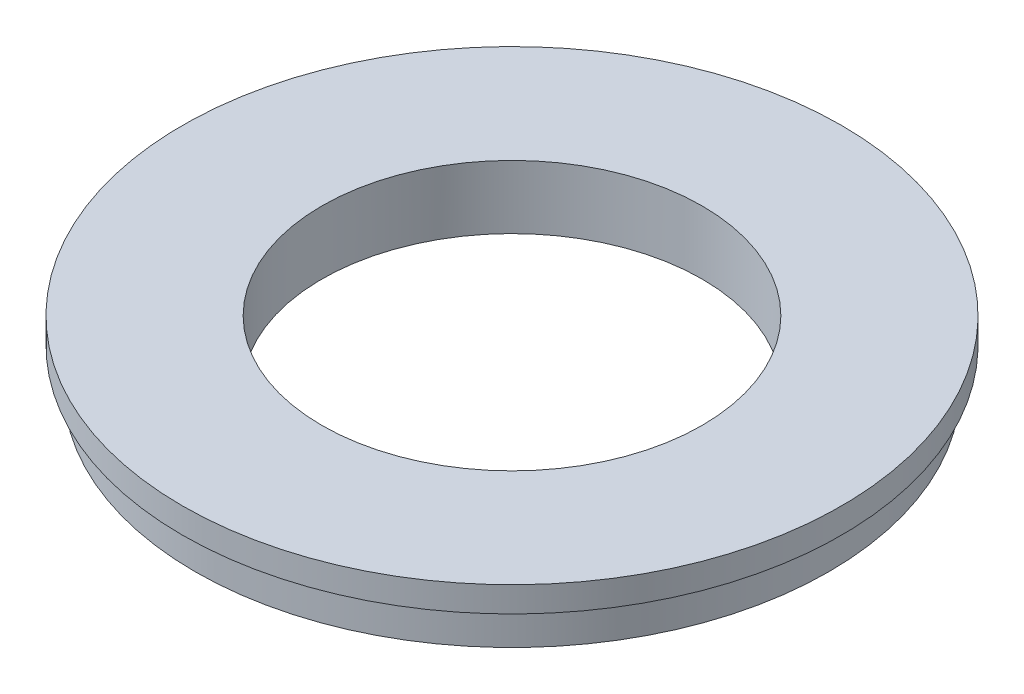
ISO-10303-21;
HEADER;
FILE_DESCRIPTION(('STEP AP214'),'2;1');
FILE_NAME('part.step','',(''),(''),'','','');
FILE_SCHEMA(('AUTOMOTIVE_DESIGN { 1 0 10303 214 1 1 1 1 }'));
ENDSEC;
DATA;
#1=APPLICATION_CONTEXT('core data for automotive mechanical design processes');
#2=APPLICATION_PROTOCOL_DEFINITION('international standard','automotive_design',2000,#1);
#3=PRODUCT_CONTEXT('',#1,'mechanical');
#4=PRODUCT('Part','Part','',(#3));
#5=PRODUCT_RELATED_PRODUCT_CATEGORY('part','',(#4));
#6=PRODUCT_DEFINITION_FORMATION('','',#4);
#7=PRODUCT_DEFINITION_CONTEXT('part definition',#1,'design');
#8=PRODUCT_DEFINITION('design','',#6,#7);
#9=PRODUCT_DEFINITION_SHAPE('','',#8);
#10=(LENGTH_UNIT() NAMED_UNIT(*) SI_UNIT(.MILLI.,.METRE.));
#11=(NAMED_UNIT(*) PLANE_ANGLE_UNIT() SI_UNIT($,.RADIAN.));
#12=(NAMED_UNIT(*) SI_UNIT($,.STERADIAN.) SOLID_ANGLE_UNIT());
#13=UNCERTAINTY_MEASURE_WITH_UNIT(LENGTH_MEASURE(1.E-05),#10,'distance_accuracy_value','');
#14=(GEOMETRIC_REPRESENTATION_CONTEXT(3) GLOBAL_UNCERTAINTY_ASSIGNED_CONTEXT((#13)) GLOBAL_UNIT_ASSIGNED_CONTEXT((#10,
#11,#12)) REPRESENTATION_CONTEXT('',''));
#15=CARTESIAN_POINT('',(0.,0.,0.));
#16=DIRECTION('',(0.,0.,1.));
#17=DIRECTION('',(1.,0.,0.));
#18=AXIS2_PLACEMENT_3D('',#15,#16,#17);
#19=CARTESIAN_POINT('',(0.,2.,0.));
#20=DIRECTION('',(0.,1.,0.));
#21=DIRECTION('',(0.,0.,1.));
#22=AXIS2_PLACEMENT_3D('',#19,#20,#21);
#23=PLANE('',#22);
#24=CARTESIAN_POINT('',(0.,2.,0.));
#25=DIRECTION('',(0.,1.,0.));
#26=DIRECTION('',(0.,0.,1.));
#27=AXIS2_PLACEMENT_3D('',#24,#25,#26);
#28=CIRCLE('',#27,26.);
#29=CARTESIAN_POINT('',(0.,2.,26.));
#30=VERTEX_POINT('',#29);
#31=EDGE_CURVE('E46',#30,#30,#28,.T.);
#32=ORIENTED_EDGE('',*,*,#31,.T.);
#33=EDGE_LOOP('',(#32));
#34=FACE_BOUND('',#33,.T.);
#35=CARTESIAN_POINT('',(0.,2.,0.));
#36=DIRECTION('',(0.,1.,0.));
#37=DIRECTION('',(0.,0.,1.));
#38=AXIS2_PLACEMENT_3D('',#35,#36,#37);
#39=CIRCLE('',#38,15.);
#40=CARTESIAN_POINT('',(0.,2.,15.));
#41=VERTEX_POINT('',#40);
#42=EDGE_CURVE('E56',#41,#41,#39,.T.);
#43=ORIENTED_EDGE('',*,*,#42,.F.);
#44=EDGE_LOOP('',(#43));
#45=FACE_BOUND('',#44,.T.);
#46=ADVANCED_FACE('F37',(#34,#45),#23,.T.);
#47=CARTESIAN_POINT('',(0.,0.,0.));
#48=DIRECTION('',(0.,1.,0.));
#49=DIRECTION('',(0.,0.,1.));
#50=AXIS2_PLACEMENT_3D('',#47,#48,#49);
#51=PLANE('',#50);
#52=CARTESIAN_POINT('',(0.,0.,0.));
#53=DIRECTION('',(0.,-1.,0.));
#54=DIRECTION('',(0.,0.,-1.));
#55=AXIS2_PLACEMENT_3D('',#52,#53,#54);
#56=CIRCLE('',#55,25.);
#57=CARTESIAN_POINT('',(0.,0.,-25.));
#58=VERTEX_POINT('',#57);
#59=EDGE_CURVE('E10',#58,#58,#56,.T.);
#60=ORIENTED_EDGE('',*,*,#59,.F.);
#61=EDGE_LOOP('',(#60));
#62=FACE_BOUND('',#61,.T.);
#63=CARTESIAN_POINT('',(0.,0.,0.));
#64=DIRECTION('',(0.,1.,0.));
#65=DIRECTION('',(0.,0.,1.));
#66=AXIS2_PLACEMENT_3D('',#63,#64,#65);
#67=CIRCLE('',#66,26.);
#68=CARTESIAN_POINT('',(0.,0.,26.));
#69=VERTEX_POINT('',#68);
#70=EDGE_CURVE('E41',#69,#69,#67,.T.);
#71=ORIENTED_EDGE('',*,*,#70,.F.);
#72=EDGE_LOOP('',(#71));
#73=FACE_BOUND('',#72,.T.);
#74=ADVANCED_FACE('F86',(#62,#73),#51,.F.);
#75=CARTESIAN_POINT('',(0.,2.,0.));
#76=DIRECTION('',(0.,-1.,0.));
#77=DIRECTION('',(0.,0.,-1.));
#78=AXIS2_PLACEMENT_3D('',#75,#76,#77);
#79=CYLINDRICAL_SURFACE('',#78,26.);
#80=ORIENTED_EDGE('',*,*,#31,.F.);
#81=EDGE_LOOP('',(#80));
#82=FACE_BOUND('',#81,.T.);
#83=ORIENTED_EDGE('',*,*,#70,.T.);
#84=EDGE_LOOP('',(#83));
#85=FACE_BOUND('',#84,.T.);
#86=ADVANCED_FACE('F39',(#82,#85),#79,.T.);
#87=CARTESIAN_POINT('',(0.,2.,0.));
#88=DIRECTION('',(0.,-1.,0.));
#89=DIRECTION('',(0.,0.,-1.));
#90=AXIS2_PLACEMENT_3D('',#87,#88,#89);
#91=CYLINDRICAL_SURFACE('',#90,15.);
#92=ORIENTED_EDGE('',*,*,#42,.T.);
#93=EDGE_LOOP('',(#92));
#94=FACE_BOUND('',#93,.T.);
#95=CARTESIAN_POINT('',(0.,-3.,0.));
#96=DIRECTION('',(0.,-1.,0.));
#97=DIRECTION('',(0.,0.,-1.));
#98=AXIS2_PLACEMENT_3D('',#95,#96,#97);
#99=CIRCLE('',#98,15.);
#100=CARTESIAN_POINT('',(0.,-3.,-15.));
#101=VERTEX_POINT('',#100);
#102=EDGE_CURVE('E65',#101,#101,#99,.T.);
#103=ORIENTED_EDGE('',*,*,#102,.T.);
#104=EDGE_LOOP('',(#103));
#105=FACE_BOUND('',#104,.T.);
#106=ADVANCED_FACE('F72',(#94,#105),#91,.F.);
#107=CARTESIAN_POINT('',(0.,-3.,0.));
#108=DIRECTION('',(0.,-1.,0.));
#109=DIRECTION('',(0.,0.,-1.));
#110=AXIS2_PLACEMENT_3D('',#107,#108,#109);
#111=PLANE('',#110);
#112=CARTESIAN_POINT('',(0.,-3.,0.));
#113=DIRECTION('',(0.,-1.,0.));
#114=DIRECTION('',(0.,0.,-1.));
#115=AXIS2_PLACEMENT_3D('',#112,#113,#114);
#116=CIRCLE('',#115,25.);
#117=CARTESIAN_POINT('',(0.,-3.,-25.));
#118=VERTEX_POINT('',#117);
#119=EDGE_CURVE('E54',#118,#118,#116,.T.);
#120=ORIENTED_EDGE('',*,*,#119,.T.);
#121=EDGE_LOOP('',(#120));
#122=FACE_BOUND('',#121,.T.);
#123=ORIENTED_EDGE('',*,*,#102,.F.);
#124=EDGE_LOOP('',(#123));
#125=FACE_BOUND('',#124,.T.);
#126=ADVANCED_FACE('F74',(#122,#125),#111,.T.);
#127=CARTESIAN_POINT('',(0.,-3.,0.));
#128=DIRECTION('',(0.,1.,0.));
#129=DIRECTION('',(0.,0.,1.));
#130=AXIS2_PLACEMENT_3D('',#127,#128,#129);
#131=CYLINDRICAL_SURFACE('',#130,25.);
#132=ORIENTED_EDGE('',*,*,#119,.F.);
#133=EDGE_LOOP('',(#132));
#134=FACE_BOUND('',#133,.T.);
#135=ORIENTED_EDGE('',*,*,#59,.T.);
#136=EDGE_LOOP('',(#135));
#137=FACE_BOUND('',#136,.T.);
#138=ADVANCED_FACE('F76',(#134,#137),#131,.T.);
#139=CLOSED_SHELL('',(#46,#74,#86,#106,#126,#138));
#140=MANIFOLD_SOLID_BREP('B2',#139);
#141=ADVANCED_BREP_SHAPE_REPRESENTATION('',(#18,#140),#14);
#142=SHAPE_DEFINITION_REPRESENTATION(#9,#141);
ENDSEC;
END-ISO-10303-21;
